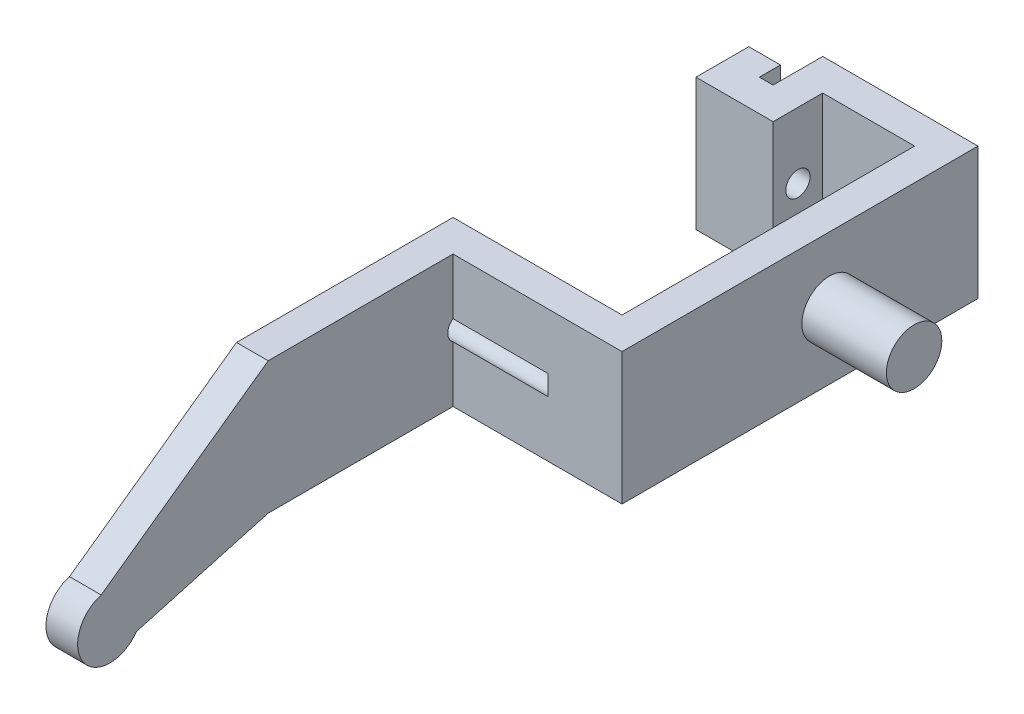
ISO-10303-21;
HEADER;
FILE_DESCRIPTION(('STEP AP214'),'2;1');
FILE_NAME('part.step','',(''),(''),'','','');
FILE_SCHEMA(('AUTOMOTIVE_DESIGN { 1 0 10303 214 1 1 1 1 }'));
ENDSEC;
DATA;
#1=APPLICATION_CONTEXT('core data for automotive mechanical design processes');
#2=APPLICATION_PROTOCOL_DEFINITION('international standard','automotive_design',2000,#1);
#3=PRODUCT_CONTEXT('',#1,'mechanical');
#4=PRODUCT('Part','Part','',(#3));
#5=PRODUCT_RELATED_PRODUCT_CATEGORY('part','',(#4));
#6=PRODUCT_DEFINITION_FORMATION('','',#4);
#7=PRODUCT_DEFINITION_CONTEXT('part definition',#1,'design');
#8=PRODUCT_DEFINITION('design','',#6,#7);
#9=PRODUCT_DEFINITION_SHAPE('','',#8);
#10=(LENGTH_UNIT() NAMED_UNIT(*) SI_UNIT(.MILLI.,.METRE.));
#11=(NAMED_UNIT(*) PLANE_ANGLE_UNIT() SI_UNIT($,.RADIAN.));
#12=(NAMED_UNIT(*) SI_UNIT($,.STERADIAN.) SOLID_ANGLE_UNIT());
#13=UNCERTAINTY_MEASURE_WITH_UNIT(LENGTH_MEASURE(1.E-05),#10,'distance_accuracy_value','');
#14=(GEOMETRIC_REPRESENTATION_CONTEXT(3) GLOBAL_UNCERTAINTY_ASSIGNED_CONTEXT((#13)) GLOBAL_UNIT_ASSIGNED_CONTEXT((#10,
#11,#12)) REPRESENTATION_CONTEXT('',''));
#15=CARTESIAN_POINT('',(0.,0.,0.));
#16=DIRECTION('',(0.,0.,1.));
#17=DIRECTION('',(1.,0.,0.));
#18=AXIS2_PLACEMENT_3D('',#15,#16,#17);
#19=CARTESIAN_POINT('',(0.,0.,0.));
#20=DIRECTION('',(0.,1.,0.));
#21=DIRECTION('',(0.,0.,1.));
#22=AXIS2_PLACEMENT_3D('',#19,#20,#21);
#23=PLANE('',#22);
#24=DIRECTION('',(1.,0.,0.));
#25=VECTOR('',#24,1.);
#26=CARTESIAN_POINT('',(0.,0.,43.5));
#27=LINE('',#26,#25);
#28=CARTESIAN_POINT('',(0.,0.,43.5));
#29=VERTEX_POINT('',#28);
#30=CARTESIAN_POINT('',(3.,0.,43.5));
#31=VERTEX_POINT('',#30);
#32=EDGE_CURVE('E52',#29,#31,#27,.T.);
#33=ORIENTED_EDGE('',*,*,#32,.F.);
#34=DIRECTION('',(0.,0.,1.));
#35=VECTOR('',#34,1.);
#36=CARTESIAN_POINT('',(0.,0.,0.));
#37=LINE('',#36,#35);
#38=CARTESIAN_POINT('',(0.,0.,23.));
#39=VERTEX_POINT('',#38);
#40=EDGE_CURVE('E203',#39,#29,#37,.T.);
#41=ORIENTED_EDGE('',*,*,#40,.F.);
#42=DIRECTION('',(-1.,0.,0.));
#43=VECTOR('',#42,1.);
#44=CARTESIAN_POINT('',(0.,0.,23.));
#45=LINE('',#44,#43);
#46=CARTESIAN_POINT('',(16.,0.,23.));
#47=VERTEX_POINT('',#46);
#48=EDGE_CURVE('E290',#47,#39,#45,.T.);
#49=ORIENTED_EDGE('',*,*,#48,.F.);
#50=DIRECTION('',(0.,0.,-1.));
#51=VECTOR('',#50,1.);
#52=CARTESIAN_POINT('',(16.,0.,0.));
#53=LINE('',#52,#51);
#54=CARTESIAN_POINT('',(16.,0.,-4.7));
#55=VERTEX_POINT('',#54);
#56=EDGE_CURVE('E243',#47,#55,#53,.T.);
#57=ORIENTED_EDGE('',*,*,#56,.T.);
#58=DIRECTION('',(1.,0.,0.));
#59=VECTOR('',#58,1.);
#60=CARTESIAN_POINT('',(0.,0.,-4.7));
#61=LINE('',#60,#59);
#62=CARTESIAN_POINT('',(7.3,0.,-4.7));
#63=VERTEX_POINT('',#62);
#64=EDGE_CURVE('E248',#63,#55,#61,.T.);
#65=ORIENTED_EDGE('',*,*,#64,.F.);
#66=DIRECTION('',(0.,0.,1.));
#67=VECTOR('',#66,1.);
#68=CARTESIAN_POINT('',(7.3,0.,0.));
#69=LINE('',#68,#67);
#70=CARTESIAN_POINT('',(7.3,0.,0.));
#71=VERTEX_POINT('',#70);
#72=EDGE_CURVE('E320',#63,#71,#69,.T.);
#73=ORIENTED_EDGE('',*,*,#72,.T.);
#74=DIRECTION('',(1.,0.,0.));
#75=VECTOR('',#74,1.);
#76=CARTESIAN_POINT('',(0.,0.,0.));
#77=LINE('',#76,#75);
#78=CARTESIAN_POINT('',(0.,0.,0.));
#79=VERTEX_POINT('',#78);
#80=EDGE_CURVE('E317',#79,#71,#77,.T.);
#81=ORIENTED_EDGE('',*,*,#80,.F.);
#82=DIRECTION('',(0.,0.,-1.));
#83=VECTOR('',#82,1.);
#84=CARTESIAN_POINT('',(0.,0.,0.));
#85=LINE('',#84,#83);
#86=CARTESIAN_POINT('',(0.,0.,-5.));
#87=VERTEX_POINT('',#86);
#88=EDGE_CURVE('E314',#79,#87,#85,.T.);
#89=ORIENTED_EDGE('',*,*,#88,.T.);
#90=DIRECTION('',(1.,0.,0.));
#91=VECTOR('',#90,1.);
#92=CARTESIAN_POINT('',(0.,0.,-5.));
#93=LINE('',#92,#91);
#94=CARTESIAN_POINT('',(3.,0.,-5.));
#95=VERTEX_POINT('',#94);
#96=EDGE_CURVE('E311',#87,#95,#93,.T.);
#97=ORIENTED_EDGE('',*,*,#96,.T.);
#98=DIRECTION('',(0.,0.,1.));
#99=VECTOR('',#98,1.);
#100=CARTESIAN_POINT('',(3.,0.,0.));
#101=LINE('',#100,#99);
#102=CARTESIAN_POINT('',(3.,0.,-3.));
#103=VERTEX_POINT('',#102);
#104=EDGE_CURVE('E308',#95,#103,#101,.T.);
#105=ORIENTED_EDGE('',*,*,#104,.T.);
#106=DIRECTION('',(1.,0.,0.));
#107=VECTOR('',#106,1.);
#108=CARTESIAN_POINT('',(0.,0.,-3.));
#109=LINE('',#108,#107);
#110=CARTESIAN_POINT('',(4.3,0.,-3.));
#111=VERTEX_POINT('',#110);
#112=EDGE_CURVE('E305',#103,#111,#109,.T.);
#113=ORIENTED_EDGE('',*,*,#112,.T.);
#114=DIRECTION('',(0.,0.,-1.));
#115=VECTOR('',#114,1.);
#116=CARTESIAN_POINT('',(4.3,0.,0.));
#117=LINE('',#116,#115);
#118=CARTESIAN_POINT('',(4.3,0.,-7.7));
#119=VERTEX_POINT('',#118);
#120=EDGE_CURVE('E302',#111,#119,#117,.T.);
#121=ORIENTED_EDGE('',*,*,#120,.T.);
#122=DIRECTION('',(1.,0.,0.));
#123=VECTOR('',#122,1.);
#124=CARTESIAN_POINT('',(0.,0.,-7.7));
#125=LINE('',#124,#123);
#126=CARTESIAN_POINT('',(19.,0.,-7.7));
#127=VERTEX_POINT('',#126);
#128=EDGE_CURVE('E299',#119,#127,#125,.T.);
#129=ORIENTED_EDGE('',*,*,#128,.T.);
#130=DIRECTION('',(0.,0.,1.));
#131=VECTOR('',#130,1.);
#132=CARTESIAN_POINT('',(19.,0.,0.));
#133=LINE('',#132,#131);
#134=CARTESIAN_POINT('',(19.,0.,26.));
#135=VERTEX_POINT('',#134);
#136=EDGE_CURVE('E296',#127,#135,#133,.T.);
#137=ORIENTED_EDGE('',*,*,#136,.T.);
#138=DIRECTION('',(-1.,0.,0.));
#139=VECTOR('',#138,1.);
#140=CARTESIAN_POINT('',(0.,0.,26.));
#141=LINE('',#140,#139);
#142=CARTESIAN_POINT('',(3.,0.,26.));
#143=VERTEX_POINT('',#142);
#144=EDGE_CURVE('E294',#135,#143,#141,.T.);
#145=ORIENTED_EDGE('',*,*,#144,.T.);
#146=DIRECTION('',(0.,0.,1.));
#147=VECTOR('',#146,1.);
#148=CARTESIAN_POINT('',(2.99999999999999,0.,0.));
#149=LINE('',#148,#147);
#150=EDGE_CURVE('E57',#143,#31,#149,.T.);
#151=ORIENTED_EDGE('',*,*,#150,.T.);
#152=EDGE_LOOP('',(#33,#41,#49,#57,#65,#73,#81,#89,#97,#105,#113,#121,#129,#137,#145,#151));
#153=FACE_BOUND('',#152,.T.);
#154=ADVANCED_FACE('F37',(#153),#23,.F.);
#155=CARTESIAN_POINT('',(0.,12.5,0.));
#156=DIRECTION('',(1.,0.,0.));
#157=DIRECTION('',(0.,0.,-1.));
#158=AXIS2_PLACEMENT_3D('',#155,#156,#157);
#159=PLANE('',#158);
#160=CARTESIAN_POINT('',(0.,6.25,25.35));
#161=DIRECTION('',(-1.,0.,0.));
#162=DIRECTION('',(0.,0.,1.));
#163=AXIS2_PLACEMENT_3D('',#160,#161,#162);
#164=CIRCLE('',#163,1.15);
#165=CARTESIAN_POINT('',(0.,6.25,26.5));
#166=VERTEX_POINT('',#165);
#167=EDGE_CURVE('E221',#166,#166,#164,.T.);
#168=ORIENTED_EDGE('',*,*,#167,.F.);
#169=EDGE_LOOP('',(#168));
#170=FACE_BOUND('',#169,.T.);
#171=CARTESIAN_POINT('',(0.,-1.73414268940798,58.4871863170623));
#172=DIRECTION('',(1.,0.,0.));
#173=DIRECTION('',(0.,0.,-1.));
#174=AXIS2_PLACEMENT_3D('',#171,#172,#173);
#175=CIRCLE('',#174,3.05311045859563);
#176=CARTESIAN_POINT('',(0.,1.20526788290863,59.3126249639279));
#177=VERTEX_POINT('',#176);
#178=CARTESIAN_POINT('',(0.,-3.46828537881596,55.9743726341246));
#179=VERTEX_POINT('',#178);
#180=EDGE_CURVE('E187',#177,#179,#175,.T.);
#181=ORIENTED_EDGE('',*,*,#180,.F.);
#182=DIRECTION('',(0.,0.581238193719096,-0.813733471206735));
#183=VECTOR('',#182,1.);
#184=CARTESIAN_POINT('',(0.,33.0743243243243,14.6959459459459));
#185=LINE('',#184,#183);
#186=CARTESIAN_POINT('',(0.,12.5,43.5));
#187=VERTEX_POINT('',#186);
#188=EDGE_CURVE('E197',#177,#187,#185,.T.);
#189=ORIENTED_EDGE('',*,*,#188,.T.);
#190=DIRECTION('',(0.,0.,1.));
#191=VECTOR('',#190,1.);
#192=CARTESIAN_POINT('',(0.,12.5,0.));
#193=LINE('',#192,#191);
#194=CARTESIAN_POINT('',(0.,12.5,23.));
#195=VERTEX_POINT('',#194);
#196=EDGE_CURVE('E250',#195,#187,#193,.T.);
#197=ORIENTED_EDGE('',*,*,#196,.F.);
#198=DIRECTION('',(0.,-1.,0.));
#199=VECTOR('',#198,1.);
#200=CARTESIAN_POINT('',(0.,12.5,23.));
#201=LINE('',#200,#199);
#202=EDGE_CURVE('E354',#195,#39,#201,.T.);
#203=ORIENTED_EDGE('',*,*,#202,.T.);
#204=ORIENTED_EDGE('',*,*,#40,.T.);
#205=DIRECTION('',(0.,-0.26787200310575,0.963454508501628));
#206=VECTOR('',#205,1.);
#207=CARTESIAN_POINT('',(0.,11.2265882755715,3.12136033708308));
#208=LINE('',#207,#206);
#209=EDGE_CURVE('E200',#29,#179,#208,.T.);
#210=ORIENTED_EDGE('',*,*,#209,.T.);
#211=EDGE_LOOP('',(#181,#189,#197,#203,#204,#210));
#212=FACE_BOUND('',#211,.T.);
#213=ADVANCED_FACE('F201',(#170,#212),#159,.F.);
#214=CARTESIAN_POINT('',(2.99999999999999,12.5,0.));
#215=DIRECTION('',(1.,0.,0.));
#216=DIRECTION('',(0.,0.,-1.));
#217=AXIS2_PLACEMENT_3D('',#214,#215,#216);
#218=PLANE('',#217);
#219=DIRECTION('',(0.,0.581238193719096,-0.813733471206735));
#220=VECTOR('',#219,1.);
#221=CARTESIAN_POINT('',(3.,28.8513513513513,20.6081081081081));
#222=LINE('',#221,#220);
#223=CARTESIAN_POINT('',(3.,1.20526788290863,59.3126249639279));
#224=VERTEX_POINT('',#223);
#225=CARTESIAN_POINT('',(3.,12.5,43.5));
#226=VERTEX_POINT('',#225);
#227=EDGE_CURVE('E214',#224,#226,#222,.T.);
#228=ORIENTED_EDGE('',*,*,#227,.F.);
#229=CARTESIAN_POINT('',(3.,-1.73414268940798,58.4871863170623));
#230=DIRECTION('',(1.,0.,0.));
#231=DIRECTION('',(0.,0.,-1.));
#232=AXIS2_PLACEMENT_3D('',#229,#230,#231);
#233=CIRCLE('',#232,3.05311045859563);
#234=CARTESIAN_POINT('',(3.,-3.46828537881596,55.9743726341246));
#235=VERTEX_POINT('',#234);
#236=EDGE_CURVE('E209',#224,#235,#233,.T.);
#237=ORIENTED_EDGE('',*,*,#236,.T.);
#238=DIRECTION('',(0.,-0.26787200310575,0.963454508501628));
#239=VECTOR('',#238,1.);
#240=CARTESIAN_POINT('',(2.99999999999999,11.2265882755715,3.12136033708308));
#241=LINE('',#240,#239);
#242=EDGE_CURVE('E205',#31,#235,#241,.T.);
#243=ORIENTED_EDGE('',*,*,#242,.F.);
#244=ORIENTED_EDGE('',*,*,#150,.F.);
#245=DIRECTION('',(0.,-1.,0.));
#246=VECTOR('',#245,1.);
#247=CARTESIAN_POINT('',(3.,12.5,26.));
#248=LINE('',#247,#246);
#249=CARTESIAN_POINT('',(3.,5.30131670194948,26.));
#250=VERTEX_POINT('',#249);
#251=EDGE_CURVE('E350',#250,#143,#248,.T.);
#252=ORIENTED_EDGE('',*,*,#251,.F.);
#253=CARTESIAN_POINT('',(3.,6.25,25.35));
#254=DIRECTION('',(1.,0.,0.));
#255=DIRECTION('',(0.,0.,-1.));
#256=AXIS2_PLACEMENT_3D('',#253,#254,#255);
#257=CIRCLE('',#256,1.15);
#258=CARTESIAN_POINT('',(3.,7.19868329805052,26.));
#259=VERTEX_POINT('',#258);
#260=EDGE_CURVE('E241',#259,#250,#257,.T.);
#261=ORIENTED_EDGE('',*,*,#260,.F.);
#262=CARTESIAN_POINT('',(3.,12.5,26.));
#263=VERTEX_POINT('',#262);
#264=EDGE_CURVE('E351',#263,#259,#248,.T.);
#265=ORIENTED_EDGE('',*,*,#264,.F.);
#266=DIRECTION('',(0.,0.,1.));
#267=VECTOR('',#266,1.);
#268=CARTESIAN_POINT('',(2.99999999999999,12.5,0.));
#269=LINE('',#268,#267);
#270=EDGE_CURVE('E253',#263,#226,#269,.T.);
#271=ORIENTED_EDGE('',*,*,#270,.T.);
#272=EDGE_LOOP('',(#228,#237,#243,#244,#252,#261,#265,#271));
#273=FACE_BOUND('',#272,.T.);
#274=ADVANCED_FACE('F376',(#273),#218,.T.);
#275=CARTESIAN_POINT('',(0.,12.5,-3.));
#276=DIRECTION('',(0.,0.,-1.));
#277=DIRECTION('',(-1.,0.,0.));
#278=AXIS2_PLACEMENT_3D('',#275,#276,#277);
#279=PLANE('',#278);
#280=DIRECTION('',(-1.,0.,0.));
#281=VECTOR('',#280,1.);
#282=CARTESIAN_POINT('',(12.,5.30131670194949,-3.));
#283=LINE('',#282,#281);
#284=CARTESIAN_POINT('',(4.3,5.30131670194949,-3.));
#285=VERTEX_POINT('',#284);
#286=CARTESIAN_POINT('',(3.,5.30131670194949,-3.));
#287=VERTEX_POINT('',#286);
#288=EDGE_CURVE('E237',#285,#287,#283,.T.);
#289=ORIENTED_EDGE('',*,*,#288,.F.);
#290=DIRECTION('',(0.,-1.,0.));
#291=VECTOR('',#290,1.);
#292=CARTESIAN_POINT('',(4.3,12.5,-3.));
#293=LINE('',#292,#291);
#294=EDGE_CURVE('E340',#285,#111,#293,.T.);
#295=ORIENTED_EDGE('',*,*,#294,.T.);
#296=ORIENTED_EDGE('',*,*,#112,.F.);
#297=DIRECTION('',(0.,-1.,0.));
#298=VECTOR('',#297,1.);
#299=CARTESIAN_POINT('',(3.,12.5,-3.));
#300=LINE('',#299,#298);
#301=EDGE_CURVE('E336',#287,#103,#300,.T.);
#302=ORIENTED_EDGE('',*,*,#301,.F.);
#303=EDGE_LOOP('',(#289,#295,#296,#302));
#304=FACE_BOUND('',#303,.T.);
#305=ADVANCED_FACE('F480',(#304),#279,.T.);
#306=CARTESIAN_POINT('',(16.,12.5,0.));
#307=DIRECTION('',(-1.,0.,0.));
#308=DIRECTION('',(0.,0.,1.));
#309=AXIS2_PLACEMENT_3D('',#306,#307,#308);
#310=PLANE('',#309);
#311=ORIENTED_EDGE('',*,*,#56,.F.);
#312=DIRECTION('',(0.,-1.,0.));
#313=VECTOR('',#312,1.);
#314=CARTESIAN_POINT('',(16.,12.5,23.));
#315=LINE('',#314,#313);
#316=CARTESIAN_POINT('',(16.,12.5,23.));
#317=VERTEX_POINT('',#316);
#318=EDGE_CURVE('E356',#317,#47,#315,.T.);
#319=ORIENTED_EDGE('',*,*,#318,.F.);
#320=DIRECTION('',(0.,0.,-1.));
#321=VECTOR('',#320,1.);
#322=CARTESIAN_POINT('',(16.,12.5,0.));
#323=LINE('',#322,#321);
#324=CARTESIAN_POINT('',(16.,12.5,-4.7));
#325=VERTEX_POINT('',#324);
#326=EDGE_CURVE('E244',#317,#325,#323,.T.);
#327=ORIENTED_EDGE('',*,*,#326,.T.);
#328=DIRECTION('',(0.,-1.,0.));
#329=VECTOR('',#328,1.);
#330=CARTESIAN_POINT('',(16.,12.5,-4.7));
#331=LINE('',#330,#329);
#332=EDGE_CURVE('E287',#325,#55,#331,.T.);
#333=ORIENTED_EDGE('',*,*,#332,.T.);
#334=EDGE_LOOP('',(#311,#319,#327,#333));
#335=FACE_BOUND('',#334,.T.);
#336=ADVANCED_FACE('F39',(#335),#310,.T.);
#337=CARTESIAN_POINT('',(0.,12.5,23.));
#338=DIRECTION('',(0.,0.,1.));
#339=DIRECTION('',(1.,0.,0.));
#340=AXIS2_PLACEMENT_3D('',#337,#338,#339);
#341=PLANE('',#340);
#342=ORIENTED_EDGE('',*,*,#48,.T.);
#343=ORIENTED_EDGE('',*,*,#202,.F.);
#344=DIRECTION('',(-1.,0.,0.));
#345=VECTOR('',#344,1.);
#346=CARTESIAN_POINT('',(0.,12.5,23.));
#347=LINE('',#346,#345);
#348=EDGE_CURVE('E247',#317,#195,#347,.T.);
#349=ORIENTED_EDGE('',*,*,#348,.F.);
#350=ORIENTED_EDGE('',*,*,#318,.T.);
#351=EDGE_LOOP('',(#342,#343,#349,#350));
#352=FACE_BOUND('',#351,.T.);
#353=ADVANCED_FACE('F436',(#352),#341,.F.);
#354=CARTESIAN_POINT('',(0.,12.5,26.));
#355=DIRECTION('',(0.,0.,1.));
#356=DIRECTION('',(1.,0.,0.));
#357=AXIS2_PLACEMENT_3D('',#354,#355,#356);
#358=PLANE('',#357);
#359=DIRECTION('',(-1.,0.,0.));
#360=VECTOR('',#359,1.);
#361=CARTESIAN_POINT('',(12.,7.19868329805052,26.));
#362=LINE('',#361,#360);
#363=CARTESIAN_POINT('',(12.,7.19868329805052,26.));
#364=VERTEX_POINT('',#363);
#365=EDGE_CURVE('E224',#364,#259,#362,.T.);
#366=ORIENTED_EDGE('',*,*,#365,.F.);
#367=DIRECTION('',(0.,-1.,0.));
#368=VECTOR('',#367,1.);
#369=CARTESIAN_POINT('',(12.,12.5,26.));
#370=LINE('',#369,#368);
#371=CARTESIAN_POINT('',(12.,5.30131670194948,26.));
#372=VERTEX_POINT('',#371);
#373=EDGE_CURVE('E358',#364,#372,#370,.T.);
#374=ORIENTED_EDGE('',*,*,#373,.T.);
#375=DIRECTION('',(-1.,0.,0.));
#376=VECTOR('',#375,1.);
#377=CARTESIAN_POINT('',(12.,5.30131670194948,26.));
#378=LINE('',#377,#376);
#379=EDGE_CURVE('E363',#250,#372,#378,.F.);
#380=ORIENTED_EDGE('',*,*,#379,.F.);
#381=ORIENTED_EDGE('',*,*,#251,.T.);
#382=ORIENTED_EDGE('',*,*,#144,.F.);
#383=DIRECTION('',(0.,-1.,0.));
#384=VECTOR('',#383,1.);
#385=CARTESIAN_POINT('',(19.,12.5,26.));
#386=LINE('',#385,#384);
#387=CARTESIAN_POINT('',(19.,12.5,26.));
#388=VERTEX_POINT('',#387);
#389=EDGE_CURVE('E348',#388,#135,#386,.T.);
#390=ORIENTED_EDGE('',*,*,#389,.F.);
#391=DIRECTION('',(-1.,0.,0.));
#392=VECTOR('',#391,1.);
#393=CARTESIAN_POINT('',(0.,12.5,26.));
#394=LINE('',#393,#392);
#395=EDGE_CURVE('E256',#388,#263,#394,.T.);
#396=ORIENTED_EDGE('',*,*,#395,.T.);
#397=ORIENTED_EDGE('',*,*,#264,.T.);
#398=EDGE_LOOP('',(#366,#374,#380,#381,#382,#390,#396,#397));
#399=FACE_BOUND('',#398,.T.);
#400=ADVANCED_FACE('F378',(#399),#358,.T.);
#401=CARTESIAN_POINT('',(19.,12.5,0.));
#402=DIRECTION('',(1.,0.,0.));
#403=DIRECTION('',(0.,0.,-1.));
#404=AXIS2_PLACEMENT_3D('',#401,#402,#403);
#405=PLANE('',#404);
#406=CARTESIAN_POINT('',(19.,6.25,6.35));
#407=DIRECTION('',(1.,0.,0.));
#408=DIRECTION('',(0.,0.,-1.));
#409=AXIS2_PLACEMENT_3D('',#406,#407,#408);
#410=CIRCLE('',#409,2.625);
#411=CARTESIAN_POINT('',(19.,6.25,3.725));
#412=VERTEX_POINT('',#411);
#413=EDGE_CURVE('E45',#412,#412,#410,.T.);
#414=ORIENTED_EDGE('',*,*,#413,.F.);
#415=EDGE_LOOP('',(#414));
#416=FACE_BOUND('',#415,.T.);
#417=ORIENTED_EDGE('',*,*,#136,.F.);
#418=DIRECTION('',(0.,-1.,0.));
#419=VECTOR('',#418,1.);
#420=CARTESIAN_POINT('',(19.,12.5,-7.7));
#421=LINE('',#420,#419);
#422=CARTESIAN_POINT('',(19.,12.5,-7.7));
#423=VERTEX_POINT('',#422);
#424=EDGE_CURVE('E346',#423,#127,#421,.T.);
#425=ORIENTED_EDGE('',*,*,#424,.F.);
#426=DIRECTION('',(0.,0.,1.));
#427=VECTOR('',#426,1.);
#428=CARTESIAN_POINT('',(19.,12.5,0.));
#429=LINE('',#428,#427);
#430=EDGE_CURVE('E259',#423,#388,#429,.T.);
#431=ORIENTED_EDGE('',*,*,#430,.T.);
#432=ORIENTED_EDGE('',*,*,#389,.T.);
#433=EDGE_LOOP('',(#417,#425,#431,#432));
#434=FACE_BOUND('',#433,.T.);
#435=ADVANCED_FACE('F388',(#416,#434),#405,.T.);
#436=CARTESIAN_POINT('',(0.,12.5,-7.7));
#437=DIRECTION('',(0.,0.,-1.));
#438=DIRECTION('',(-1.,0.,0.));
#439=AXIS2_PLACEMENT_3D('',#436,#437,#438);
#440=PLANE('',#439);
#441=ORIENTED_EDGE('',*,*,#128,.F.);
#442=DIRECTION('',(0.,-1.,0.));
#443=VECTOR('',#442,1.);
#444=CARTESIAN_POINT('',(4.3,12.5,-7.7));
#445=LINE('',#444,#443);
#446=CARTESIAN_POINT('',(4.3,12.5,-7.7));
#447=VERTEX_POINT('',#446);
#448=EDGE_CURVE('E344',#447,#119,#445,.T.);
#449=ORIENTED_EDGE('',*,*,#448,.F.);
#450=DIRECTION('',(1.,0.,0.));
#451=VECTOR('',#450,1.);
#452=CARTESIAN_POINT('',(0.,12.5,-7.7));
#453=LINE('',#452,#451);
#454=EDGE_CURVE('E262',#447,#423,#453,.T.);
#455=ORIENTED_EDGE('',*,*,#454,.T.);
#456=ORIENTED_EDGE('',*,*,#424,.T.);
#457=EDGE_LOOP('',(#441,#449,#455,#456));
#458=FACE_BOUND('',#457,.T.);
#459=ADVANCED_FACE('F391',(#458),#440,.T.);
#460=CARTESIAN_POINT('',(4.3,12.5,0.));
#461=DIRECTION('',(-1.,0.,0.));
#462=DIRECTION('',(0.,0.,1.));
#463=AXIS2_PLACEMENT_3D('',#460,#461,#462);
#464=PLANE('',#463);
#465=CARTESIAN_POINT('',(4.3,6.25,-2.35));
#466=DIRECTION('',(-1.,0.,0.));
#467=DIRECTION('',(0.,0.,1.));
#468=AXIS2_PLACEMENT_3D('',#465,#466,#467);
#469=CIRCLE('',#468,1.15);
#470=CARTESIAN_POINT('',(4.3,7.19868329805051,-3.));
#471=VERTEX_POINT('',#470);
#472=EDGE_CURVE('E239',#471,#285,#469,.T.);
#473=ORIENTED_EDGE('',*,*,#472,.F.);
#474=CARTESIAN_POINT('',(4.3,12.5,-3.));
#475=VERTEX_POINT('',#474);
#476=EDGE_CURVE('E341',#475,#471,#293,.T.);
#477=ORIENTED_EDGE('',*,*,#476,.F.);
#478=DIRECTION('',(0.,0.,-1.));
#479=VECTOR('',#478,1.);
#480=CARTESIAN_POINT('',(4.3,12.5,0.));
#481=LINE('',#480,#479);
#482=EDGE_CURVE('E265',#475,#447,#481,.T.);
#483=ORIENTED_EDGE('',*,*,#482,.T.);
#484=ORIENTED_EDGE('',*,*,#448,.T.);
#485=ORIENTED_EDGE('',*,*,#120,.F.);
#486=ORIENTED_EDGE('',*,*,#294,.F.);
#487=EDGE_LOOP('',(#473,#477,#483,#484,#485,#486));
#488=FACE_BOUND('',#487,.T.);
#489=ADVANCED_FACE('F396',(#488),#464,.T.);
#490=DIRECTION('',(-1.,0.,0.));
#491=VECTOR('',#490,1.);
#492=CARTESIAN_POINT('',(12.,7.19868329805051,-3.));
#493=LINE('',#492,#491);
#494=CARTESIAN_POINT('',(3.,7.19868329805051,-3.));
#495=VERTEX_POINT('',#494);
#496=EDGE_CURVE('E235',#495,#471,#493,.F.);
#497=ORIENTED_EDGE('',*,*,#496,.F.);
#498=CARTESIAN_POINT('',(3.,12.5,-3.));
#499=VERTEX_POINT('',#498);
#500=EDGE_CURVE('E337',#499,#495,#300,.T.);
#501=ORIENTED_EDGE('',*,*,#500,.F.);
#502=DIRECTION('',(1.,0.,0.));
#503=VECTOR('',#502,1.);
#504=CARTESIAN_POINT('',(0.,12.5,-3.));
#505=LINE('',#504,#503);
#506=EDGE_CURVE('E268',#499,#475,#505,.T.);
#507=ORIENTED_EDGE('',*,*,#506,.T.);
#508=ORIENTED_EDGE('',*,*,#476,.T.);
#509=EDGE_LOOP('',(#497,#501,#507,#508));
#510=FACE_BOUND('',#509,.T.);
#511=ADVANCED_FACE('F401',(#510),#279,.T.);
#512=CARTESIAN_POINT('',(3.,12.5,0.));
#513=DIRECTION('',(1.,0.,0.));
#514=DIRECTION('',(0.,0.,-1.));
#515=AXIS2_PLACEMENT_3D('',#512,#513,#514);
#516=PLANE('',#515);
#517=CARTESIAN_POINT('',(3.,6.25,-2.35));
#518=DIRECTION('',(1.,0.,0.));
#519=DIRECTION('',(0.,0.,-1.));
#520=AXIS2_PLACEMENT_3D('',#517,#518,#519);
#521=CIRCLE('',#520,1.15);
#522=EDGE_CURVE('E233',#287,#495,#521,.T.);
#523=ORIENTED_EDGE('',*,*,#522,.F.);
#524=ORIENTED_EDGE('',*,*,#301,.T.);
#525=ORIENTED_EDGE('',*,*,#104,.F.);
#526=DIRECTION('',(0.,-1.,0.));
#527=VECTOR('',#526,1.);
#528=CARTESIAN_POINT('',(3.,12.5,-5.));
#529=LINE('',#528,#527);
#530=CARTESIAN_POINT('',(3.,12.5,-5.));
#531=VERTEX_POINT('',#530);
#532=EDGE_CURVE('E334',#531,#95,#529,.T.);
#533=ORIENTED_EDGE('',*,*,#532,.F.);
#534=DIRECTION('',(0.,0.,1.));
#535=VECTOR('',#534,1.);
#536=CARTESIAN_POINT('',(3.,12.5,0.));
#537=LINE('',#536,#535);
#538=EDGE_CURVE('E271',#531,#499,#537,.T.);
#539=ORIENTED_EDGE('',*,*,#538,.T.);
#540=ORIENTED_EDGE('',*,*,#500,.T.);
#541=EDGE_LOOP('',(#523,#524,#525,#533,#539,#540));
#542=FACE_BOUND('',#541,.T.);
#543=ADVANCED_FACE('F406',(#542),#516,.T.);
#544=CARTESIAN_POINT('',(0.,12.5,-5.));
#545=DIRECTION('',(0.,0.,-1.));
#546=DIRECTION('',(-1.,0.,0.));
#547=AXIS2_PLACEMENT_3D('',#544,#545,#546);
#548=PLANE('',#547);
#549=ORIENTED_EDGE('',*,*,#96,.F.);
#550=DIRECTION('',(0.,-1.,0.));
#551=VECTOR('',#550,1.);
#552=CARTESIAN_POINT('',(0.,12.5,-5.));
#553=LINE('',#552,#551);
#554=CARTESIAN_POINT('',(0.,12.5,-5.));
#555=VERTEX_POINT('',#554);
#556=EDGE_CURVE('E332',#555,#87,#553,.T.);
#557=ORIENTED_EDGE('',*,*,#556,.F.);
#558=DIRECTION('',(1.,0.,0.));
#559=VECTOR('',#558,1.);
#560=CARTESIAN_POINT('',(0.,12.5,-5.));
#561=LINE('',#560,#559);
#562=EDGE_CURVE('E274',#555,#531,#561,.T.);
#563=ORIENTED_EDGE('',*,*,#562,.T.);
#564=ORIENTED_EDGE('',*,*,#532,.T.);
#565=EDGE_LOOP('',(#549,#557,#563,#564));
#566=FACE_BOUND('',#565,.T.);
#567=ADVANCED_FACE('F410',(#566),#548,.T.);
#568=CARTESIAN_POINT('',(0.,12.5,0.));
#569=DIRECTION('',(-1.,0.,0.));
#570=DIRECTION('',(0.,0.,1.));
#571=AXIS2_PLACEMENT_3D('',#568,#569,#570);
#572=PLANE('',#571);
#573=CARTESIAN_POINT('',(0.,6.25,-2.35));
#574=DIRECTION('',(-1.,0.,0.));
#575=DIRECTION('',(0.,0.,1.));
#576=AXIS2_PLACEMENT_3D('',#573,#574,#575);
#577=CIRCLE('',#576,1.15);
#578=CARTESIAN_POINT('',(0.,6.25,-1.2));
#579=VERTEX_POINT('',#578);
#580=EDGE_CURVE('E225',#579,#579,#577,.T.);
#581=ORIENTED_EDGE('',*,*,#580,.F.);
#582=EDGE_LOOP('',(#581));
#583=FACE_BOUND('',#582,.T.);
#584=ORIENTED_EDGE('',*,*,#88,.F.);
#585=DIRECTION('',(0.,-1.,0.));
#586=VECTOR('',#585,1.);
#587=CARTESIAN_POINT('',(0.,12.5,0.));
#588=LINE('',#587,#586);
#589=CARTESIAN_POINT('',(0.,12.5,0.));
#590=VERTEX_POINT('',#589);
#591=EDGE_CURVE('E330',#590,#79,#588,.T.);
#592=ORIENTED_EDGE('',*,*,#591,.F.);
#593=DIRECTION('',(0.,0.,-1.));
#594=VECTOR('',#593,1.);
#595=CARTESIAN_POINT('',(0.,12.5,0.));
#596=LINE('',#595,#594);
#597=EDGE_CURVE('E277',#590,#555,#596,.T.);
#598=ORIENTED_EDGE('',*,*,#597,.T.);
#599=ORIENTED_EDGE('',*,*,#556,.T.);
#600=EDGE_LOOP('',(#584,#592,#598,#599));
#601=FACE_BOUND('',#600,.T.);
#602=ADVANCED_FACE('F414',(#583,#601),#572,.T.);
#603=CARTESIAN_POINT('',(0.,12.5,0.));
#604=DIRECTION('',(0.,0.,-1.));
#605=DIRECTION('',(-1.,0.,0.));
#606=AXIS2_PLACEMENT_3D('',#603,#604,#605);
#607=PLANE('',#606);
#608=ORIENTED_EDGE('',*,*,#80,.T.);
#609=DIRECTION('',(0.,-1.,0.));
#610=VECTOR('',#609,1.);
#611=CARTESIAN_POINT('',(7.3,12.5,0.));
#612=LINE('',#611,#610);
#613=CARTESIAN_POINT('',(7.3,12.5,0.));
#614=VERTEX_POINT('',#613);
#615=EDGE_CURVE('E328',#614,#71,#612,.T.);
#616=ORIENTED_EDGE('',*,*,#615,.F.);
#617=DIRECTION('',(1.,0.,0.));
#618=VECTOR('',#617,1.);
#619=CARTESIAN_POINT('',(0.,12.5,0.));
#620=LINE('',#619,#618);
#621=EDGE_CURVE('E280',#590,#614,#620,.T.);
#622=ORIENTED_EDGE('',*,*,#621,.F.);
#623=ORIENTED_EDGE('',*,*,#591,.T.);
#624=EDGE_LOOP('',(#608,#616,#622,#623));
#625=FACE_BOUND('',#624,.T.);
#626=ADVANCED_FACE('F419',(#625),#607,.F.);
#627=CARTESIAN_POINT('',(7.3,12.5,0.));
#628=DIRECTION('',(1.,0.,0.));
#629=DIRECTION('',(0.,0.,-1.));
#630=AXIS2_PLACEMENT_3D('',#627,#628,#629);
#631=PLANE('',#630);
#632=CARTESIAN_POINT('',(7.3,6.25,-2.35));
#633=DIRECTION('',(1.,0.,0.));
#634=DIRECTION('',(0.,0.,-1.));
#635=AXIS2_PLACEMENT_3D('',#632,#633,#634);
#636=CIRCLE('',#635,1.15);
#637=CARTESIAN_POINT('',(7.3,6.25,-3.5));
#638=VERTEX_POINT('',#637);
#639=EDGE_CURVE('E228',#638,#638,#636,.T.);
#640=ORIENTED_EDGE('',*,*,#639,.F.);
#641=EDGE_LOOP('',(#640));
#642=FACE_BOUND('',#641,.T.);
#643=ORIENTED_EDGE('',*,*,#72,.F.);
#644=DIRECTION('',(0.,-1.,0.));
#645=VECTOR('',#644,1.);
#646=CARTESIAN_POINT('',(7.3,12.5,-4.7));
#647=LINE('',#646,#645);
#648=CARTESIAN_POINT('',(7.3,12.5,-4.7));
#649=VERTEX_POINT('',#648);
#650=EDGE_CURVE('E326',#649,#63,#647,.T.);
#651=ORIENTED_EDGE('',*,*,#650,.F.);
#652=DIRECTION('',(0.,0.,1.));
#653=VECTOR('',#652,1.);
#654=CARTESIAN_POINT('',(7.3,12.5,0.));
#655=LINE('',#654,#653);
#656=EDGE_CURVE('E282',#649,#614,#655,.T.);
#657=ORIENTED_EDGE('',*,*,#656,.T.);
#658=ORIENTED_EDGE('',*,*,#615,.T.);
#659=EDGE_LOOP('',(#643,#651,#657,#658));
#660=FACE_BOUND('',#659,.T.);
#661=ADVANCED_FACE('F426',(#642,#660),#631,.T.);
#662=CARTESIAN_POINT('',(0.,12.5,-4.7));
#663=DIRECTION('',(0.,0.,-1.));
#664=DIRECTION('',(-1.,0.,0.));
#665=AXIS2_PLACEMENT_3D('',#662,#663,#664);
#666=PLANE('',#665);
#667=ORIENTED_EDGE('',*,*,#64,.T.);
#668=ORIENTED_EDGE('',*,*,#332,.F.);
#669=DIRECTION('',(1.,0.,0.));
#670=VECTOR('',#669,1.);
#671=CARTESIAN_POINT('',(0.,12.5,-4.7));
#672=LINE('',#671,#670);
#673=EDGE_CURVE('E285',#649,#325,#672,.T.);
#674=ORIENTED_EDGE('',*,*,#673,.F.);
#675=ORIENTED_EDGE('',*,*,#650,.T.);
#676=EDGE_LOOP('',(#667,#668,#674,#675));
#677=FACE_BOUND('',#676,.T.);
#678=ADVANCED_FACE('F429',(#677),#666,.F.);
#679=CARTESIAN_POINT('',(0.,12.5,0.));
#680=DIRECTION('',(0.,1.,0.));
#681=DIRECTION('',(0.,0.,1.));
#682=AXIS2_PLACEMENT_3D('',#679,#680,#681);
#683=PLANE('',#682);
#684=DIRECTION('',(-1.,0.,0.));
#685=VECTOR('',#684,1.);
#686=CARTESIAN_POINT('',(0.,12.5,43.5));
#687=LINE('',#686,#685);
#688=EDGE_CURVE('E11',#226,#187,#687,.T.);
#689=ORIENTED_EDGE('',*,*,#688,.F.);
#690=ORIENTED_EDGE('',*,*,#270,.F.);
#691=ORIENTED_EDGE('',*,*,#395,.F.);
#692=ORIENTED_EDGE('',*,*,#430,.F.);
#693=ORIENTED_EDGE('',*,*,#454,.F.);
#694=ORIENTED_EDGE('',*,*,#482,.F.);
#695=ORIENTED_EDGE('',*,*,#506,.F.);
#696=ORIENTED_EDGE('',*,*,#538,.F.);
#697=ORIENTED_EDGE('',*,*,#562,.F.);
#698=ORIENTED_EDGE('',*,*,#597,.F.);
#699=ORIENTED_EDGE('',*,*,#621,.T.);
#700=ORIENTED_EDGE('',*,*,#656,.F.);
#701=ORIENTED_EDGE('',*,*,#673,.T.);
#702=ORIENTED_EDGE('',*,*,#326,.F.);
#703=ORIENTED_EDGE('',*,*,#348,.T.);
#704=ORIENTED_EDGE('',*,*,#196,.T.);
#705=EDGE_LOOP('',(#689,#690,#691,#692,#693,#694,#695,#696,#697,#698,#699,#700,#701,#702,#703,#704));
#706=FACE_BOUND('',#705,.T.);
#707=ADVANCED_FACE('F384',(#706),#683,.T.);
#708=CARTESIAN_POINT('',(12.,6.25,-2.35));
#709=DIRECTION('',(-1.,0.,0.));
#710=DIRECTION('',(0.,0.,1.));
#711=AXIS2_PLACEMENT_3D('',#708,#709,#710);
#712=CYLINDRICAL_SURFACE('',#711,1.15);
#713=ORIENTED_EDGE('',*,*,#472,.T.);
#714=ORIENTED_EDGE('',*,*,#288,.T.);
#715=ORIENTED_EDGE('',*,*,#522,.T.);
#716=ORIENTED_EDGE('',*,*,#496,.T.);
#717=EDGE_LOOP('',(#713,#714,#715,#716));
#718=FACE_BOUND('',#717,.T.);
#719=ORIENTED_EDGE('',*,*,#639,.T.);
#720=EDGE_LOOP('',(#719));
#721=FACE_BOUND('',#720,.T.);
#722=ORIENTED_EDGE('',*,*,#580,.T.);
#723=EDGE_LOOP('',(#722));
#724=FACE_BOUND('',#723,.T.);
#725=ADVANCED_FACE('F452',(#718,#721,#724),#712,.F.);
#726=CARTESIAN_POINT('',(12.,6.25,25.35));
#727=DIRECTION('',(-1.,0.,0.));
#728=DIRECTION('',(0.,0.,1.));
#729=AXIS2_PLACEMENT_3D('',#726,#727,#728);
#730=CYLINDRICAL_SURFACE('',#729,1.15);
#731=ORIENTED_EDGE('',*,*,#365,.T.);
#732=ORIENTED_EDGE('',*,*,#260,.T.);
#733=ORIENTED_EDGE('',*,*,#379,.T.);
#734=CARTESIAN_POINT('',(12.,6.25,25.35));
#735=DIRECTION('',(-1.,0.,0.));
#736=DIRECTION('',(0.,0.,1.));
#737=AXIS2_PLACEMENT_3D('',#734,#735,#736);
#738=CIRCLE('',#737,1.15);
#739=EDGE_CURVE('E229',#364,#372,#738,.T.);
#740=ORIENTED_EDGE('',*,*,#739,.F.);
#741=EDGE_LOOP('',(#731,#732,#733,#740));
#742=FACE_BOUND('',#741,.T.);
#743=ORIENTED_EDGE('',*,*,#167,.T.);
#744=EDGE_LOOP('',(#743));
#745=FACE_BOUND('',#744,.T.);
#746=ADVANCED_FACE('F369',(#742,#745),#730,.F.);
#747=CARTESIAN_POINT('',(12.,0.,0.));
#748=DIRECTION('',(-1.,0.,0.));
#749=DIRECTION('',(0.,0.,1.));
#750=AXIS2_PLACEMENT_3D('',#747,#748,#749);
#751=PLANE('',#750);
#752=ORIENTED_EDGE('',*,*,#739,.T.);
#753=ORIENTED_EDGE('',*,*,#373,.F.);
#754=EDGE_LOOP('',(#752,#753));
#755=FACE_BOUND('',#754,.T.);
#756=ADVANCED_FACE('F441',(#755),#751,.T.);
#757=CARTESIAN_POINT('',(27.,6.25,6.34999999999999));
#758=DIRECTION('',(-1.,0.,0.));
#759=DIRECTION('',(0.,0.,1.));
#760=AXIS2_PLACEMENT_3D('',#757,#758,#759);
#761=CYLINDRICAL_SURFACE('',#760,2.625);
#762=CARTESIAN_POINT('',(27.,6.25,6.34999999999999));
#763=DIRECTION('',(1.,0.,0.));
#764=DIRECTION('',(0.,0.,-1.));
#765=AXIS2_PLACEMENT_3D('',#762,#763,#764);
#766=CIRCLE('',#765,2.625);
#767=CARTESIAN_POINT('',(27.,6.25,3.72499999999999));
#768=VERTEX_POINT('',#767);
#769=EDGE_CURVE('E218',#768,#768,#766,.T.);
#770=ORIENTED_EDGE('',*,*,#769,.F.);
#771=EDGE_LOOP('',(#770));
#772=FACE_BOUND('',#771,.T.);
#773=ORIENTED_EDGE('',*,*,#413,.T.);
#774=EDGE_LOOP('',(#773));
#775=FACE_BOUND('',#774,.T.);
#776=ADVANCED_FACE('F443',(#772,#775),#761,.T.);
#777=CARTESIAN_POINT('',(27.,0.,0.));
#778=DIRECTION('',(1.,0.,0.));
#779=DIRECTION('',(0.,0.,-1.));
#780=AXIS2_PLACEMENT_3D('',#777,#778,#779);
#781=PLANE('',#780);
#782=ORIENTED_EDGE('',*,*,#769,.T.);
#783=EDGE_LOOP('',(#782));
#784=FACE_BOUND('',#783,.T.);
#785=ADVANCED_FACE('F449',(#784),#781,.T.);
#786=CARTESIAN_POINT('',(-5.,28.8513513513513,20.6081081081081));
#787=DIRECTION('',(0.,-0.813733471206735,-0.581238193719096));
#788=DIRECTION('',(0.,0.581238193719096,-0.813733471206735));
#789=AXIS2_PLACEMENT_3D('',#786,#787,#788);
#790=PLANE('',#789);
#791=DIRECTION('',(1.,0.,0.));
#792=VECTOR('',#791,1.);
#793=CARTESIAN_POINT('',(-5.,1.20526788290863,59.3126249639279));
#794=LINE('',#793,#792);
#795=EDGE_CURVE('E194',#177,#224,#794,.T.);
#796=ORIENTED_EDGE('',*,*,#795,.T.);
#797=ORIENTED_EDGE('',*,*,#227,.T.);
#798=ORIENTED_EDGE('',*,*,#688,.T.);
#799=ORIENTED_EDGE('',*,*,#188,.F.);
#800=EDGE_LOOP('',(#796,#797,#798,#799));
#801=FACE_BOUND('',#800,.T.);
#802=ADVANCED_FACE('F439',(#801),#790,.F.);
#803=CARTESIAN_POINT('',(-5.,-1.73414268940798,58.4871863170623));
#804=DIRECTION('',(1.,0.,0.));
#805=DIRECTION('',(0.,0.,-1.));
#806=AXIS2_PLACEMENT_3D('',#803,#804,#805);
#807=CYLINDRICAL_SURFACE('',#806,3.05311045859563);
#808=ORIENTED_EDGE('',*,*,#180,.T.);
#809=DIRECTION('',(1.,0.,0.));
#810=VECTOR('',#809,1.);
#811=CARTESIAN_POINT('',(0.,-3.46828537881596,55.9743726341246));
#812=LINE('',#811,#810);
#813=EDGE_CURVE('E192',#179,#235,#812,.T.);
#814=ORIENTED_EDGE('',*,*,#813,.T.);
#815=ORIENTED_EDGE('',*,*,#236,.F.);
#816=ORIENTED_EDGE('',*,*,#795,.F.);
#817=EDGE_LOOP('',(#808,#814,#815,#816));
#818=FACE_BOUND('',#817,.T.);
#819=ADVANCED_FACE('F189',(#818),#807,.T.);
#820=CARTESIAN_POINT('',(0.,11.2265882755715,3.12136033708308));
#821=DIRECTION('',(0.,0.963454508501628,0.26787200310575));
#822=DIRECTION('',(0.,-0.26787200310575,0.963454508501628));
#823=AXIS2_PLACEMENT_3D('',#820,#821,#822);
#824=PLANE('',#823);
#825=ORIENTED_EDGE('',*,*,#242,.T.);
#826=ORIENTED_EDGE('',*,*,#813,.F.);
#827=ORIENTED_EDGE('',*,*,#209,.F.);
#828=ORIENTED_EDGE('',*,*,#32,.T.);
#829=EDGE_LOOP('',(#825,#826,#827,#828));
#830=FACE_BOUND('',#829,.T.);
#831=ADVANCED_FACE('F207',(#830),#824,.F.);
#832=CLOSED_SHELL('',(#154,#213,#274,#305,#336,#353,#400,#435,#459,#489,#511,#543,#567,#602,
#626,#661,#678,#707,#725,#746,#756,#776,#785,#802,#819,#831));
#833=MANIFOLD_SOLID_BREP('B2',#832);
#834=ADVANCED_BREP_SHAPE_REPRESENTATION('',(#18,#833),#14);
#835=SHAPE_DEFINITION_REPRESENTATION(#9,#834);
ENDSEC;
END-ISO-10303-21;
